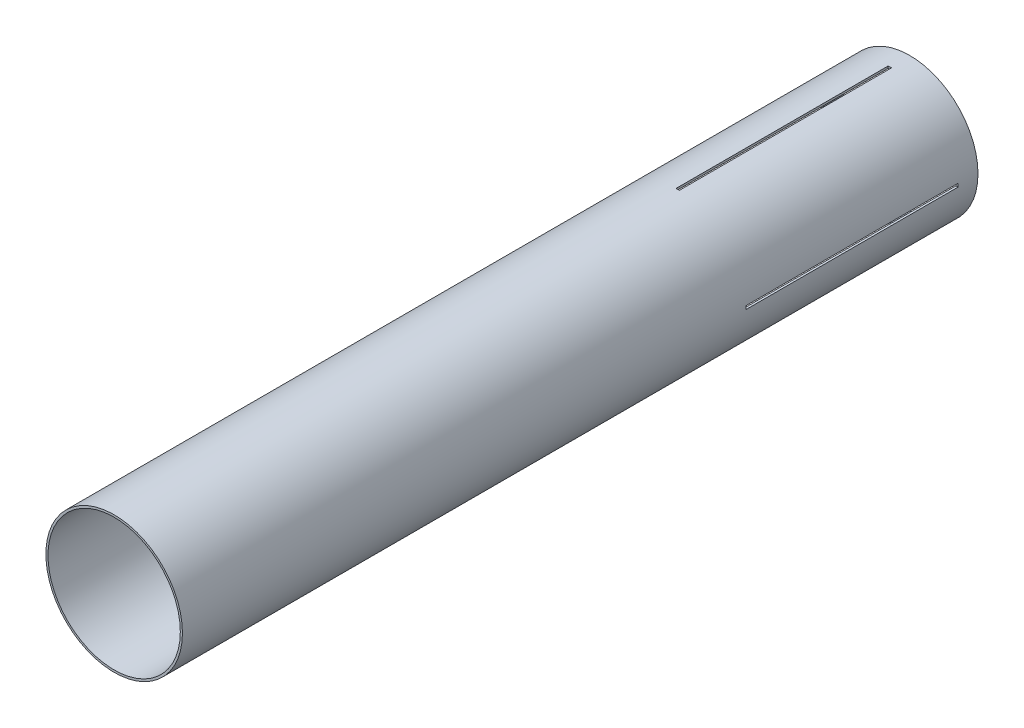
ISO-10303-21;
HEADER;
FILE_DESCRIPTION(('STEP AP214'),'2;1');
FILE_NAME('part.step','',(''),(''),'','','');
FILE_SCHEMA(('AUTOMOTIVE_DESIGN { 1 0 10303 214 1 1 1 1 }'));
ENDSEC;
DATA;
#1=APPLICATION_CONTEXT('core data for automotive mechanical design processes');
#2=APPLICATION_PROTOCOL_DEFINITION('international standard','automotive_design',2000,#1);
#3=PRODUCT_CONTEXT('',#1,'mechanical');
#4=PRODUCT('Part','Part','',(#3));
#5=PRODUCT_RELATED_PRODUCT_CATEGORY('part','',(#4));
#6=PRODUCT_DEFINITION_FORMATION('','',#4);
#7=PRODUCT_DEFINITION_CONTEXT('part definition',#1,'design');
#8=PRODUCT_DEFINITION('design','',#6,#7);
#9=PRODUCT_DEFINITION_SHAPE('','',#8);
#10=(LENGTH_UNIT() NAMED_UNIT(*) SI_UNIT(.MILLI.,.METRE.));
#11=(NAMED_UNIT(*) PLANE_ANGLE_UNIT() SI_UNIT($,.RADIAN.));
#12=(NAMED_UNIT(*) SI_UNIT($,.STERADIAN.) SOLID_ANGLE_UNIT());
#13=UNCERTAINTY_MEASURE_WITH_UNIT(LENGTH_MEASURE(1.E-05),#10,'distance_accuracy_value','');
#14=(GEOMETRIC_REPRESENTATION_CONTEXT(3) GLOBAL_UNCERTAINTY_ASSIGNED_CONTEXT((#13)) GLOBAL_UNIT_ASSIGNED_CONTEXT((#10,
#11,#12)) REPRESENTATION_CONTEXT('',''));
#15=CARTESIAN_POINT('',(0.,0.,0.));
#16=DIRECTION('',(0.,0.,1.));
#17=DIRECTION('',(1.,0.,0.));
#18=AXIS2_PLACEMENT_3D('',#15,#16,#17);
#19=CARTESIAN_POINT('',(0.,0.,381.));
#20=DIRECTION('',(0.,0.,-1.));
#21=DIRECTION('',(-1.,0.,0.));
#22=AXIS2_PLACEMENT_3D('',#19,#20,#21);
#23=CYLINDRICAL_SURFACE('',#22,65.405);
#24=CARTESIAN_POINT('',(0.,0.,-158.75));
#25=DIRECTION('',(0.,0.,-1.));
#26=DIRECTION('',(-1.,0.,0.));
#27=AXIS2_PLACEMENT_3D('',#24,#25,#26);
#28=CIRCLE('',#27,65.405);
#29=CARTESIAN_POINT('',(-65.3857313849895,-1.58750000000023,-158.75));
#30=VERTEX_POINT('',#29);
#31=CARTESIAN_POINT('',(-65.3857313849895,1.58749999999977,-158.75));
#32=VERTEX_POINT('',#31);
#33=EDGE_CURVE('E216',#30,#32,#28,.T.);
#34=ORIENTED_EDGE('',*,*,#33,.F.);
#35=DIRECTION('',(0.,0.,-1.));
#36=VECTOR('',#35,1.);
#37=CARTESIAN_POINT('',(-65.3857313849895,-1.58750000000023,381.));
#38=LINE('',#37,#36);
#39=CARTESIAN_POINT('',(-65.3857313849895,-1.58750000000022,-361.95));
#40=VERTEX_POINT('',#39);
#41=EDGE_CURVE('E239',#40,#30,#38,.F.);
#42=ORIENTED_EDGE('',*,*,#41,.F.);
#43=CARTESIAN_POINT('',(0.,0.,-361.95));
#44=DIRECTION('',(0.,0.,1.));
#45=DIRECTION('',(1.,0.,0.));
#46=AXIS2_PLACEMENT_3D('',#43,#44,#45);
#47=CIRCLE('',#46,65.405);
#48=CARTESIAN_POINT('',(-65.3857313849895,1.58749999999977,-361.95));
#49=VERTEX_POINT('',#48);
#50=EDGE_CURVE('E232',#49,#40,#47,.T.);
#51=ORIENTED_EDGE('',*,*,#50,.F.);
#52=DIRECTION('',(0.,0.,-1.));
#53=VECTOR('',#52,1.);
#54=CARTESIAN_POINT('',(-65.3857313849895,1.58749999999977,381.));
#55=LINE('',#54,#53);
#56=EDGE_CURVE('E236',#32,#49,#55,.T.);
#57=ORIENTED_EDGE('',*,*,#56,.F.);
#58=EDGE_LOOP('',(#34,#42,#51,#57));
#59=FACE_BOUND('',#58,.T.);
#60=CARTESIAN_POINT('',(1.5875,-65.3857313849895,-158.75));
#61=VERTEX_POINT('',#60);
#62=CARTESIAN_POINT('',(-1.5875,-65.3857313849895,-158.75));
#63=VERTEX_POINT('',#62);
#64=EDGE_CURVE('E240',#61,#63,#28,.T.);
#65=ORIENTED_EDGE('',*,*,#64,.F.);
#66=DIRECTION('',(0.,0.,-1.));
#67=VECTOR('',#66,1.);
#68=CARTESIAN_POINT('',(1.5875,-65.3857313849895,381.));
#69=LINE('',#68,#67);
#70=CARTESIAN_POINT('',(1.5875,-65.3857313849895,-361.95));
#71=VERTEX_POINT('',#70);
#72=EDGE_CURVE('E227',#71,#61,#69,.F.);
#73=ORIENTED_EDGE('',*,*,#72,.F.);
#74=CARTESIAN_POINT('',(-1.5875,-65.3857313849895,-361.95));
#75=VERTEX_POINT('',#74);
#76=EDGE_CURVE('E59',#75,#71,#47,.T.);
#77=ORIENTED_EDGE('',*,*,#76,.F.);
#78=DIRECTION('',(0.,0.,-1.));
#79=VECTOR('',#78,1.);
#80=CARTESIAN_POINT('',(-1.5875,-65.3857313849895,381.));
#81=LINE('',#80,#79);
#82=EDGE_CURVE('E229',#63,#75,#81,.T.);
#83=ORIENTED_EDGE('',*,*,#82,.F.);
#84=EDGE_LOOP('',(#65,#73,#77,#83));
#85=FACE_BOUND('',#84,.T.);
#86=CARTESIAN_POINT('',(0.,0.,381.));
#87=DIRECTION('',(0.,0.,1.));
#88=DIRECTION('',(1.,0.,0.));
#89=AXIS2_PLACEMENT_3D('',#86,#87,#88);
#90=CIRCLE('',#89,65.405);
#91=CARTESIAN_POINT('',(65.405,0.,381.));
#92=VERTEX_POINT('',#91);
#93=EDGE_CURVE('E269',#92,#92,#90,.T.);
#94=ORIENTED_EDGE('',*,*,#93,.F.);
#95=EDGE_LOOP('',(#94));
#96=FACE_BOUND('',#95,.T.);
#97=CARTESIAN_POINT('',(0.,0.,-381.));
#98=DIRECTION('',(0.,0.,1.));
#99=DIRECTION('',(1.,0.,0.));
#100=AXIS2_PLACEMENT_3D('',#97,#98,#99);
#101=CIRCLE('',#100,65.405);
#102=CARTESIAN_POINT('',(65.405,0.,-381.));
#103=VERTEX_POINT('',#102);
#104=EDGE_CURVE('E266',#103,#103,#101,.T.);
#105=ORIENTED_EDGE('',*,*,#104,.T.);
#106=EDGE_LOOP('',(#105));
#107=FACE_BOUND('',#106,.T.);
#108=CARTESIAN_POINT('',(0.,0.,-361.95));
#109=DIRECTION('',(0.,0.,1.));
#110=DIRECTION('',(1.,0.,0.));
#111=AXIS2_PLACEMENT_3D('',#108,#109,#110);
#112=CIRCLE('',#111,65.405);
#113=CARTESIAN_POINT('',(1.5875,65.3857313849895,-361.95));
#114=VERTEX_POINT('',#113);
#115=CARTESIAN_POINT('',(-1.5875,65.3857313849895,-361.95));
#116=VERTEX_POINT('',#115);
#117=EDGE_CURVE('E254',#114,#116,#112,.T.);
#118=ORIENTED_EDGE('',*,*,#117,.F.);
#119=DIRECTION('',(0.,0.,-1.));
#120=VECTOR('',#119,1.);
#121=CARTESIAN_POINT('',(1.5875,65.3857313849895,381.));
#122=LINE('',#121,#120);
#123=CARTESIAN_POINT('',(1.5875,65.3857313849895,-158.75));
#124=VERTEX_POINT('',#123);
#125=EDGE_CURVE('E256',#124,#114,#122,.T.);
#126=ORIENTED_EDGE('',*,*,#125,.F.);
#127=CARTESIAN_POINT('',(0.,0.,-158.75));
#128=DIRECTION('',(0.,0.,-1.));
#129=DIRECTION('',(-1.,0.,0.));
#130=AXIS2_PLACEMENT_3D('',#127,#128,#129);
#131=CIRCLE('',#130,65.405);
#132=CARTESIAN_POINT('',(-1.5875,65.3857313849895,-158.75));
#133=VERTEX_POINT('',#132);
#134=EDGE_CURVE('E258',#133,#124,#131,.T.);
#135=ORIENTED_EDGE('',*,*,#134,.F.);
#136=DIRECTION('',(0.,0.,-1.));
#137=VECTOR('',#136,1.);
#138=CARTESIAN_POINT('',(-1.5875,65.3857313849895,381.));
#139=LINE('',#138,#137);
#140=EDGE_CURVE('E260',#116,#133,#139,.F.);
#141=ORIENTED_EDGE('',*,*,#140,.F.);
#142=EDGE_LOOP('',(#118,#126,#135,#141));
#143=FACE_BOUND('',#142,.T.);
#144=CARTESIAN_POINT('',(65.3857313849895,1.58750000000023,-158.75));
#145=VERTEX_POINT('',#144);
#146=CARTESIAN_POINT('',(65.3857313849895,-1.58749999999932,-158.75));
#147=VERTEX_POINT('',#146);
#148=EDGE_CURVE('E67',#145,#147,#28,.T.);
#149=ORIENTED_EDGE('',*,*,#148,.F.);
#150=DIRECTION('',(0.,0.,-1.));
#151=VECTOR('',#150,1.);
#152=CARTESIAN_POINT('',(65.3857313849895,1.58750000000023,381.));
#153=LINE('',#152,#151);
#154=CARTESIAN_POINT('',(65.3857313849895,1.58750000000023,-361.95));
#155=VERTEX_POINT('',#154);
#156=EDGE_CURVE('E234',#155,#145,#153,.F.);
#157=ORIENTED_EDGE('',*,*,#156,.F.);
#158=CARTESIAN_POINT('',(65.3857313849895,-1.58749999999932,-361.95));
#159=VERTEX_POINT('',#158);
#160=EDGE_CURVE('E231',#159,#155,#47,.T.);
#161=ORIENTED_EDGE('',*,*,#160,.F.);
#162=DIRECTION('',(0.,0.,-1.));
#163=VECTOR('',#162,1.);
#164=CARTESIAN_POINT('',(65.3857313849895,-1.58749999999932,381.));
#165=LINE('',#164,#163);
#166=EDGE_CURVE('E220',#147,#159,#165,.T.);
#167=ORIENTED_EDGE('',*,*,#166,.F.);
#168=EDGE_LOOP('',(#149,#157,#161,#167));
#169=FACE_BOUND('',#168,.T.);
#170=ADVANCED_FACE('F45',(#59,#85,#96,#107,#143,#169),#23,.T.);
#171=CARTESIAN_POINT('',(0.,0.,381.));
#172=DIRECTION('',(0.,0.,-1.));
#173=DIRECTION('',(-1.,0.,0.));
#174=AXIS2_PLACEMENT_3D('',#171,#172,#173);
#175=CYLINDRICAL_SURFACE('',#174,63.373);
#176=CARTESIAN_POINT('',(0.,0.,381.));
#177=DIRECTION('',(0.,0.,1.));
#178=DIRECTION('',(1.,0.,0.));
#179=AXIS2_PLACEMENT_3D('',#176,#177,#178);
#180=CIRCLE('',#179,63.373);
#181=CARTESIAN_POINT('',(63.373,0.,381.));
#182=VERTEX_POINT('',#181);
#183=EDGE_CURVE('E263',#182,#182,#180,.T.);
#184=ORIENTED_EDGE('',*,*,#183,.T.);
#185=EDGE_LOOP('',(#184));
#186=FACE_BOUND('',#185,.T.);
#187=CARTESIAN_POINT('',(0.,0.,-381.));
#188=DIRECTION('',(0.,0.,1.));
#189=DIRECTION('',(1.,0.,0.));
#190=AXIS2_PLACEMENT_3D('',#187,#188,#189);
#191=CIRCLE('',#190,63.373);
#192=CARTESIAN_POINT('',(63.373,0.,-381.));
#193=VERTEX_POINT('',#192);
#194=EDGE_CURVE('E262',#193,#193,#191,.T.);
#195=ORIENTED_EDGE('',*,*,#194,.F.);
#196=EDGE_LOOP('',(#195));
#197=FACE_BOUND('',#196,.T.);
#198=CARTESIAN_POINT('',(0.,0.,-361.95));
#199=DIRECTION('',(0.,0.,1.));
#200=DIRECTION('',(1.,0.,0.));
#201=AXIS2_PLACEMENT_3D('',#198,#199,#200);
#202=CIRCLE('',#201,63.373);
#203=CARTESIAN_POINT('',(1.5875,63.3531133627228,-361.95));
#204=VERTEX_POINT('',#203);
#205=CARTESIAN_POINT('',(-1.5875,63.3531133627228,-361.95));
#206=VERTEX_POINT('',#205);
#207=EDGE_CURVE('E272',#204,#206,#202,.T.);
#208=ORIENTED_EDGE('',*,*,#207,.T.);
#209=DIRECTION('',(0.,0.,-1.));
#210=VECTOR('',#209,1.);
#211=CARTESIAN_POINT('',(-1.5875,63.3531133627228,381.));
#212=LINE('',#211,#210);
#213=CARTESIAN_POINT('',(-1.5875,63.3531133627228,-158.75));
#214=VERTEX_POINT('',#213);
#215=EDGE_CURVE('E172',#206,#214,#212,.F.);
#216=ORIENTED_EDGE('',*,*,#215,.T.);
#217=CARTESIAN_POINT('',(0.,0.,-158.75));
#218=DIRECTION('',(0.,0.,-1.));
#219=DIRECTION('',(-1.,0.,0.));
#220=AXIS2_PLACEMENT_3D('',#217,#218,#219);
#221=CIRCLE('',#220,63.373);
#222=CARTESIAN_POINT('',(1.5875,63.3531133627228,-158.75));
#223=VERTEX_POINT('',#222);
#224=EDGE_CURVE('E280',#214,#223,#221,.T.);
#225=ORIENTED_EDGE('',*,*,#224,.T.);
#226=DIRECTION('',(0.,0.,-1.));
#227=VECTOR('',#226,1.);
#228=CARTESIAN_POINT('',(1.5875,63.3531133627228,381.));
#229=LINE('',#228,#227);
#230=EDGE_CURVE('E277',#223,#204,#229,.T.);
#231=ORIENTED_EDGE('',*,*,#230,.T.);
#232=EDGE_LOOP('',(#208,#216,#225,#231));
#233=FACE_BOUND('',#232,.T.);
#234=DIRECTION('',(0.,0.,-1.));
#235=VECTOR('',#234,1.);
#236=CARTESIAN_POINT('',(63.3531133627228,1.58750000000022,381.));
#237=LINE('',#236,#235);
#238=CARTESIAN_POINT('',(63.3531133627228,1.58750000000022,-361.95));
#239=VERTEX_POINT('',#238);
#240=CARTESIAN_POINT('',(63.3531133627228,1.58750000000022,-158.75));
#241=VERTEX_POINT('',#240);
#242=EDGE_CURVE('E182',#239,#241,#237,.F.);
#243=ORIENTED_EDGE('',*,*,#242,.T.);
#244=CARTESIAN_POINT('',(0.,0.,-158.75));
#245=DIRECTION('',(0.,0.,-1.));
#246=DIRECTION('',(-1.,0.,0.));
#247=AXIS2_PLACEMENT_3D('',#244,#245,#246);
#248=CIRCLE('',#247,63.373);
#249=CARTESIAN_POINT('',(63.3531133627228,-1.58749999999934,-158.75));
#250=VERTEX_POINT('',#249);
#251=EDGE_CURVE('E175',#241,#250,#248,.T.);
#252=ORIENTED_EDGE('',*,*,#251,.T.);
#253=DIRECTION('',(0.,0.,-1.));
#254=VECTOR('',#253,1.);
#255=CARTESIAN_POINT('',(63.3531133627228,-1.58749999999934,381.));
#256=LINE('',#255,#254);
#257=CARTESIAN_POINT('',(63.3531133627228,-1.58749999999934,-361.95));
#258=VERTEX_POINT('',#257);
#259=EDGE_CURVE('E160',#250,#258,#256,.T.);
#260=ORIENTED_EDGE('',*,*,#259,.T.);
#261=CARTESIAN_POINT('',(0.,0.,-361.95));
#262=DIRECTION('',(0.,0.,1.));
#263=DIRECTION('',(1.,0.,0.));
#264=AXIS2_PLACEMENT_3D('',#261,#262,#263);
#265=CIRCLE('',#264,63.373);
#266=EDGE_CURVE('E171',#258,#239,#265,.T.);
#267=ORIENTED_EDGE('',*,*,#266,.T.);
#268=EDGE_LOOP('',(#243,#252,#260,#267));
#269=FACE_BOUND('',#268,.T.);
#270=CARTESIAN_POINT('',(1.5875,-63.3531133627228,-158.75));
#271=VERTEX_POINT('',#270);
#272=CARTESIAN_POINT('',(-1.5875,-63.3531133627228,-158.75));
#273=VERTEX_POINT('',#272);
#274=EDGE_CURVE('E185',#271,#273,#248,.T.);
#275=ORIENTED_EDGE('',*,*,#274,.T.);
#276=DIRECTION('',(0.,0.,-1.));
#277=VECTOR('',#276,1.);
#278=CARTESIAN_POINT('',(-1.5875,-63.3531133627228,381.));
#279=LINE('',#278,#277);
#280=CARTESIAN_POINT('',(-1.5875,-63.3531133627228,-361.95));
#281=VERTEX_POINT('',#280);
#282=EDGE_CURVE('E193',#273,#281,#279,.T.);
#283=ORIENTED_EDGE('',*,*,#282,.T.);
#284=CARTESIAN_POINT('',(1.5875,-63.3531133627228,-361.95));
#285=VERTEX_POINT('',#284);
#286=EDGE_CURVE('E187',#281,#285,#265,.T.);
#287=ORIENTED_EDGE('',*,*,#286,.T.);
#288=DIRECTION('',(0.,0.,-1.));
#289=VECTOR('',#288,1.);
#290=CARTESIAN_POINT('',(1.5875,-63.3531133627228,381.));
#291=LINE('',#290,#289);
#292=EDGE_CURVE('E183',#285,#271,#291,.F.);
#293=ORIENTED_EDGE('',*,*,#292,.T.);
#294=EDGE_LOOP('',(#275,#283,#287,#293));
#295=FACE_BOUND('',#294,.T.);
#296=CARTESIAN_POINT('',(-63.3531133627228,1.58749999999978,-361.95));
#297=VERTEX_POINT('',#296);
#298=CARTESIAN_POINT('',(-63.3531133627228,-1.58750000000022,-361.95));
#299=VERTEX_POINT('',#298);
#300=EDGE_CURVE('E196',#297,#299,#265,.T.);
#301=ORIENTED_EDGE('',*,*,#300,.T.);
#302=DIRECTION('',(0.,0.,-1.));
#303=VECTOR('',#302,1.);
#304=CARTESIAN_POINT('',(-63.3531133627228,-1.58750000000022,381.));
#305=LINE('',#304,#303);
#306=CARTESIAN_POINT('',(-63.3531133627228,-1.58750000000022,-158.75));
#307=VERTEX_POINT('',#306);
#308=EDGE_CURVE('E11',#299,#307,#305,.F.);
#309=ORIENTED_EDGE('',*,*,#308,.T.);
#310=CARTESIAN_POINT('',(-63.3531133627228,1.58749999999978,-158.75));
#311=VERTEX_POINT('',#310);
#312=EDGE_CURVE('E52',#307,#311,#248,.T.);
#313=ORIENTED_EDGE('',*,*,#312,.T.);
#314=DIRECTION('',(0.,0.,-1.));
#315=VECTOR('',#314,1.);
#316=CARTESIAN_POINT('',(-63.3531133627228,1.58749999999978,381.));
#317=LINE('',#316,#315);
#318=EDGE_CURVE('E191',#311,#297,#317,.T.);
#319=ORIENTED_EDGE('',*,*,#318,.T.);
#320=EDGE_LOOP('',(#301,#309,#313,#319));
#321=FACE_BOUND('',#320,.T.);
#322=ADVANCED_FACE('F180',(#186,#197,#233,#269,#295,#321),#175,.F.);
#323=CARTESIAN_POINT('',(0.,0.,381.));
#324=DIRECTION('',(0.,0.,1.));
#325=DIRECTION('',(1.,0.,0.));
#326=AXIS2_PLACEMENT_3D('',#323,#324,#325);
#327=PLANE('',#326);
#328=ORIENTED_EDGE('',*,*,#93,.T.);
#329=EDGE_LOOP('',(#328));
#330=FACE_BOUND('',#329,.T.);
#331=ORIENTED_EDGE('',*,*,#183,.F.);
#332=EDGE_LOOP('',(#331));
#333=FACE_BOUND('',#332,.T.);
#334=ADVANCED_FACE('F320',(#330,#333),#327,.T.);
#335=CARTESIAN_POINT('',(0.,0.,-381.));
#336=DIRECTION('',(0.,0.,1.));
#337=DIRECTION('',(1.,0.,0.));
#338=AXIS2_PLACEMENT_3D('',#335,#336,#337);
#339=PLANE('',#338);
#340=ORIENTED_EDGE('',*,*,#104,.F.);
#341=EDGE_LOOP('',(#340));
#342=FACE_BOUND('',#341,.T.);
#343=ORIENTED_EDGE('',*,*,#194,.T.);
#344=EDGE_LOOP('',(#343));
#345=FACE_BOUND('',#344,.T.);
#346=ADVANCED_FACE('F333',(#342,#345),#339,.F.);
#347=CARTESIAN_POINT('',(-1.5875,65.405,-158.75));
#348=DIRECTION('',(1.,0.,0.));
#349=DIRECTION('',(0.,0.,-1.));
#350=AXIS2_PLACEMENT_3D('',#347,#348,#349);
#351=PLANE('',#350);
#352=ORIENTED_EDGE('',*,*,#140,.T.);
#353=DIRECTION('',(0.,-1.,0.));
#354=VECTOR('',#353,1.);
#355=CARTESIAN_POINT('',(-1.5875,65.405,-158.75));
#356=LINE('',#355,#354);
#357=EDGE_CURVE('E251',#133,#214,#356,.T.);
#358=ORIENTED_EDGE('',*,*,#357,.T.);
#359=ORIENTED_EDGE('',*,*,#215,.F.);
#360=DIRECTION('',(0.,-1.,0.));
#361=VECTOR('',#360,1.);
#362=CARTESIAN_POINT('',(-1.5875,65.405,-361.95));
#363=LINE('',#362,#361);
#364=EDGE_CURVE('E243',#116,#206,#363,.T.);
#365=ORIENTED_EDGE('',*,*,#364,.F.);
#366=EDGE_LOOP('',(#352,#358,#359,#365));
#367=FACE_BOUND('',#366,.T.);
#368=ADVANCED_FACE('F288',(#367),#351,.T.);
#369=CARTESIAN_POINT('',(1.5875,65.405,-158.75));
#370=DIRECTION('',(0.,0.,-1.));
#371=DIRECTION('',(-1.,0.,0.));
#372=AXIS2_PLACEMENT_3D('',#369,#370,#371);
#373=PLANE('',#372);
#374=ORIENTED_EDGE('',*,*,#134,.T.);
#375=DIRECTION('',(0.,-1.,0.));
#376=VECTOR('',#375,1.);
#377=CARTESIAN_POINT('',(1.5875,65.405,-158.75));
#378=LINE('',#377,#376);
#379=EDGE_CURVE('E248',#124,#223,#378,.T.);
#380=ORIENTED_EDGE('',*,*,#379,.T.);
#381=ORIENTED_EDGE('',*,*,#224,.F.);
#382=ORIENTED_EDGE('',*,*,#357,.F.);
#383=EDGE_LOOP('',(#374,#380,#381,#382));
#384=FACE_BOUND('',#383,.T.);
#385=ADVANCED_FACE('F293',(#384),#373,.T.);
#386=CARTESIAN_POINT('',(1.5875,65.405,-158.75));
#387=DIRECTION('',(-1.,0.,0.));
#388=DIRECTION('',(0.,0.,1.));
#389=AXIS2_PLACEMENT_3D('',#386,#387,#388);
#390=PLANE('',#389);
#391=ORIENTED_EDGE('',*,*,#125,.T.);
#392=DIRECTION('',(0.,-1.,0.));
#393=VECTOR('',#392,1.);
#394=CARTESIAN_POINT('',(1.5875,65.405,-361.95));
#395=LINE('',#394,#393);
#396=EDGE_CURVE('E245',#114,#204,#395,.T.);
#397=ORIENTED_EDGE('',*,*,#396,.T.);
#398=ORIENTED_EDGE('',*,*,#230,.F.);
#399=ORIENTED_EDGE('',*,*,#379,.F.);
#400=EDGE_LOOP('',(#391,#397,#398,#399));
#401=FACE_BOUND('',#400,.T.);
#402=ADVANCED_FACE('F301',(#401),#390,.T.);
#403=CARTESIAN_POINT('',(1.5875,65.405,-361.95));
#404=DIRECTION('',(0.,0.,1.));
#405=DIRECTION('',(1.,0.,0.));
#406=AXIS2_PLACEMENT_3D('',#403,#404,#405);
#407=PLANE('',#406);
#408=ORIENTED_EDGE('',*,*,#117,.T.);
#409=ORIENTED_EDGE('',*,*,#364,.T.);
#410=ORIENTED_EDGE('',*,*,#207,.F.);
#411=ORIENTED_EDGE('',*,*,#396,.F.);
#412=EDGE_LOOP('',(#408,#409,#410,#411));
#413=FACE_BOUND('',#412,.T.);
#414=ADVANCED_FACE('F303',(#413),#407,.T.);
#415=CARTESIAN_POINT('',(65.4050000000007,-1.58749999999932,-158.75));
#416=DIRECTION('',(0.,1.,0.));
#417=DIRECTION('',(-1.,0.,0.));
#418=AXIS2_PLACEMENT_3D('',#415,#416,#417);
#419=PLANE('',#418);
#420=ORIENTED_EDGE('',*,*,#166,.T.);
#421=DIRECTION('',(-1.,0.,0.));
#422=VECTOR('',#421,1.);
#423=CARTESIAN_POINT('',(65.4050000000007,-1.58749999999932,-361.95));
#424=LINE('',#423,#422);
#425=EDGE_CURVE('E166',#159,#258,#424,.T.);
#426=ORIENTED_EDGE('',*,*,#425,.T.);
#427=ORIENTED_EDGE('',*,*,#259,.F.);
#428=DIRECTION('',(-1.,0.,0.));
#429=VECTOR('',#428,1.);
#430=CARTESIAN_POINT('',(65.4050000000007,-1.58749999999932,-158.75));
#431=LINE('',#430,#429);
#432=EDGE_CURVE('E163',#147,#250,#431,.T.);
#433=ORIENTED_EDGE('',*,*,#432,.F.);
#434=EDGE_LOOP('',(#420,#426,#427,#433));
#435=FACE_BOUND('',#434,.T.);
#436=ADVANCED_FACE('F162',(#435),#419,.T.);
#437=CARTESIAN_POINT('',(-65.4050000000002,1.58749999999977,-361.95));
#438=DIRECTION('',(0.,0.,1.));
#439=DIRECTION('',(1.,0.,0.));
#440=AXIS2_PLACEMENT_3D('',#437,#438,#439);
#441=PLANE('',#440);
#442=ORIENTED_EDGE('',*,*,#160,.T.);
#443=DIRECTION('',(1.,0.,0.));
#444=VECTOR('',#443,1.);
#445=CARTESIAN_POINT('',(-65.4050000000002,1.58749999999977,-361.95));
#446=LINE('',#445,#444);
#447=EDGE_CURVE('E223',#239,#155,#446,.T.);
#448=ORIENTED_EDGE('',*,*,#447,.F.);
#449=ORIENTED_EDGE('',*,*,#266,.F.);
#450=ORIENTED_EDGE('',*,*,#425,.F.);
#451=EDGE_LOOP('',(#442,#448,#449,#450));
#452=FACE_BOUND('',#451,.T.);
#453=ADVANCED_FACE('F311',(#452),#441,.T.);
#454=CARTESIAN_POINT('',(-65.4050000000002,1.58749999999977,-158.75));
#455=DIRECTION('',(0.,-1.,0.));
#456=DIRECTION('',(1.,0.,0.));
#457=AXIS2_PLACEMENT_3D('',#454,#455,#456);
#458=PLANE('',#457);
#459=ORIENTED_EDGE('',*,*,#156,.T.);
#460=DIRECTION('',(1.,0.,0.));
#461=VECTOR('',#460,1.);
#462=CARTESIAN_POINT('',(-65.4050000000002,1.58749999999977,-158.75));
#463=LINE('',#462,#461);
#464=EDGE_CURVE('E218',#241,#145,#463,.T.);
#465=ORIENTED_EDGE('',*,*,#464,.F.);
#466=ORIENTED_EDGE('',*,*,#242,.F.);
#467=ORIENTED_EDGE('',*,*,#447,.T.);
#468=EDGE_LOOP('',(#459,#465,#466,#467));
#469=FACE_BOUND('',#468,.T.);
#470=ADVANCED_FACE('F391',(#469),#458,.T.);
#471=CARTESIAN_POINT('',(-65.4050000000002,1.58749999999977,-158.75));
#472=DIRECTION('',(0.,0.,-1.));
#473=DIRECTION('',(-1.,0.,0.));
#474=AXIS2_PLACEMENT_3D('',#471,#472,#473);
#475=PLANE('',#474);
#476=ORIENTED_EDGE('',*,*,#148,.T.);
#477=ORIENTED_EDGE('',*,*,#432,.T.);
#478=ORIENTED_EDGE('',*,*,#251,.F.);
#479=ORIENTED_EDGE('',*,*,#464,.T.);
#480=EDGE_LOOP('',(#476,#477,#478,#479));
#481=FACE_BOUND('',#480,.T.);
#482=ADVANCED_FACE('F174',(#481),#475,.T.);
#483=CARTESIAN_POINT('',(1.5875,-65.405,-158.75));
#484=DIRECTION('',(-1.,0.,0.));
#485=DIRECTION('',(0.,0.,1.));
#486=AXIS2_PLACEMENT_3D('',#483,#484,#485);
#487=PLANE('',#486);
#488=ORIENTED_EDGE('',*,*,#72,.T.);
#489=DIRECTION('',(0.,1.,0.));
#490=VECTOR('',#489,1.);
#491=CARTESIAN_POINT('',(1.5875,-65.405,-158.75));
#492=LINE('',#491,#490);
#493=EDGE_CURVE('E527',#61,#271,#492,.T.);
#494=ORIENTED_EDGE('',*,*,#493,.T.);
#495=ORIENTED_EDGE('',*,*,#292,.F.);
#496=DIRECTION('',(0.,1.,0.));
#497=VECTOR('',#496,1.);
#498=CARTESIAN_POINT('',(1.5875,-65.405,-361.95));
#499=LINE('',#498,#497);
#500=EDGE_CURVE('E177',#71,#285,#499,.T.);
#501=ORIENTED_EDGE('',*,*,#500,.F.);
#502=EDGE_LOOP('',(#488,#494,#495,#501));
#503=FACE_BOUND('',#502,.T.);
#504=ADVANCED_FACE('F421',(#503),#487,.T.);
#505=CARTESIAN_POINT('',(-1.5875,-65.405,-158.75));
#506=DIRECTION('',(1.,0.,0.));
#507=DIRECTION('',(0.,0.,-1.));
#508=AXIS2_PLACEMENT_3D('',#505,#506,#507);
#509=PLANE('',#508);
#510=ORIENTED_EDGE('',*,*,#82,.T.);
#511=DIRECTION('',(0.,1.,0.));
#512=VECTOR('',#511,1.);
#513=CARTESIAN_POINT('',(-1.5875,-65.405,-361.95));
#514=LINE('',#513,#512);
#515=EDGE_CURVE('E534',#75,#281,#514,.T.);
#516=ORIENTED_EDGE('',*,*,#515,.T.);
#517=ORIENTED_EDGE('',*,*,#282,.F.);
#518=DIRECTION('',(0.,1.,0.));
#519=VECTOR('',#518,1.);
#520=CARTESIAN_POINT('',(-1.5875,-65.405,-158.75));
#521=LINE('',#520,#519);
#522=EDGE_CURVE('E529',#63,#273,#521,.T.);
#523=ORIENTED_EDGE('',*,*,#522,.F.);
#524=EDGE_LOOP('',(#510,#516,#517,#523));
#525=FACE_BOUND('',#524,.T.);
#526=ADVANCED_FACE('F437',(#525),#509,.T.);
#527=ORIENTED_EDGE('',*,*,#76,.T.);
#528=ORIENTED_EDGE('',*,*,#500,.T.);
#529=ORIENTED_EDGE('',*,*,#286,.F.);
#530=ORIENTED_EDGE('',*,*,#515,.F.);
#531=EDGE_LOOP('',(#527,#528,#529,#530));
#532=FACE_BOUND('',#531,.T.);
#533=ADVANCED_FACE('F395',(#532),#441,.T.);
#534=ORIENTED_EDGE('',*,*,#64,.T.);
#535=ORIENTED_EDGE('',*,*,#522,.T.);
#536=ORIENTED_EDGE('',*,*,#274,.F.);
#537=ORIENTED_EDGE('',*,*,#493,.F.);
#538=EDGE_LOOP('',(#534,#535,#536,#537));
#539=FACE_BOUND('',#538,.T.);
#540=ADVANCED_FACE('F423',(#539),#475,.T.);
#541=CARTESIAN_POINT('',(-65.4050000000002,-1.58750000000023,-158.75));
#542=DIRECTION('',(0.,1.,0.));
#543=DIRECTION('',(-1.,0.,0.));
#544=AXIS2_PLACEMENT_3D('',#541,#542,#543);
#545=PLANE('',#544);
#546=ORIENTED_EDGE('',*,*,#41,.T.);
#547=DIRECTION('',(1.,0.,0.));
#548=VECTOR('',#547,1.);
#549=CARTESIAN_POINT('',(-65.4050000000002,-1.58750000000023,-158.75));
#550=LINE('',#549,#548);
#551=EDGE_CURVE('E217',#30,#307,#550,.T.);
#552=ORIENTED_EDGE('',*,*,#551,.T.);
#553=ORIENTED_EDGE('',*,*,#308,.F.);
#554=DIRECTION('',(1.,0.,0.));
#555=VECTOR('',#554,1.);
#556=CARTESIAN_POINT('',(-65.4050000000002,-1.58750000000022,-361.95));
#557=LINE('',#556,#555);
#558=EDGE_CURVE('E525',#40,#299,#557,.T.);
#559=ORIENTED_EDGE('',*,*,#558,.F.);
#560=EDGE_LOOP('',(#546,#552,#553,#559));
#561=FACE_BOUND('',#560,.T.);
#562=ADVANCED_FACE('F469',(#561),#545,.T.);
#563=ORIENTED_EDGE('',*,*,#33,.T.);
#564=EDGE_CURVE('E208',#32,#311,#463,.T.);
#565=ORIENTED_EDGE('',*,*,#564,.T.);
#566=ORIENTED_EDGE('',*,*,#312,.F.);
#567=ORIENTED_EDGE('',*,*,#551,.F.);
#568=EDGE_LOOP('',(#563,#565,#566,#567));
#569=FACE_BOUND('',#568,.T.);
#570=ADVANCED_FACE('F213',(#569),#475,.T.);
#571=ORIENTED_EDGE('',*,*,#56,.T.);
#572=EDGE_CURVE('E211',#49,#297,#446,.T.);
#573=ORIENTED_EDGE('',*,*,#572,.T.);
#574=ORIENTED_EDGE('',*,*,#318,.F.);
#575=ORIENTED_EDGE('',*,*,#564,.F.);
#576=EDGE_LOOP('',(#571,#573,#574,#575));
#577=FACE_BOUND('',#576,.T.);
#578=ADVANCED_FACE('F207',(#577),#458,.T.);
#579=ORIENTED_EDGE('',*,*,#50,.T.);
#580=ORIENTED_EDGE('',*,*,#558,.T.);
#581=ORIENTED_EDGE('',*,*,#300,.F.);
#582=ORIENTED_EDGE('',*,*,#572,.F.);
#583=EDGE_LOOP('',(#579,#580,#581,#582));
#584=FACE_BOUND('',#583,.T.);
#585=ADVANCED_FACE('F394',(#584),#441,.T.);
#586=CLOSED_SHELL('',(#170,#322,#334,#346,#368,#385,#402,#414,#436,#453,#470,#482,#504,#526,
#533,#540,#562,#570,#578,#585));
#587=MANIFOLD_SOLID_BREP('B2',#586);
#588=ADVANCED_BREP_SHAPE_REPRESENTATION('',(#18,#587),#14);
#589=SHAPE_DEFINITION_REPRESENTATION(#9,#588);
ENDSEC;
END-ISO-10303-21;
